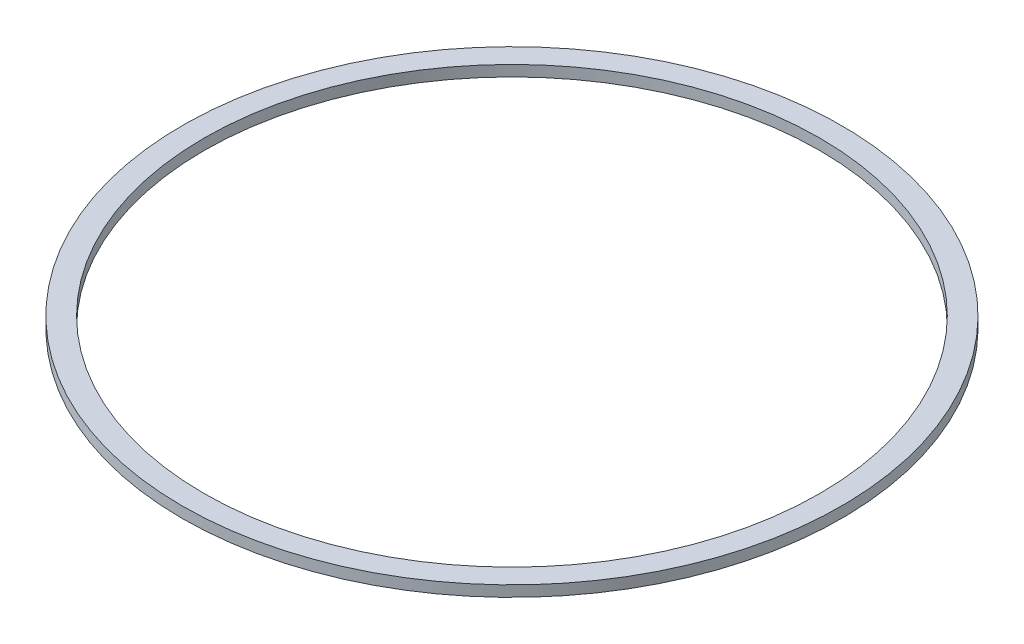
ISO-10303-21;
HEADER;
FILE_DESCRIPTION(('STEP AP214'),'2;1');
FILE_NAME('part.step','',(''),(''),'','','');
FILE_SCHEMA(('AUTOMOTIVE_DESIGN { 1 0 10303 214 1 1 1 1 }'));
ENDSEC;
DATA;
#1=APPLICATION_CONTEXT('core data for automotive mechanical design processes');
#2=APPLICATION_PROTOCOL_DEFINITION('international standard','automotive_design',2000,#1);
#3=PRODUCT_CONTEXT('',#1,'mechanical');
#4=PRODUCT('Part','Part','',(#3));
#5=PRODUCT_RELATED_PRODUCT_CATEGORY('part','',(#4));
#6=PRODUCT_DEFINITION_FORMATION('','',#4);
#7=PRODUCT_DEFINITION_CONTEXT('part definition',#1,'design');
#8=PRODUCT_DEFINITION('design','',#6,#7);
#9=PRODUCT_DEFINITION_SHAPE('','',#8);
#10=(LENGTH_UNIT() NAMED_UNIT(*) SI_UNIT(.MILLI.,.METRE.));
#11=(NAMED_UNIT(*) PLANE_ANGLE_UNIT() SI_UNIT($,.RADIAN.));
#12=(NAMED_UNIT(*) SI_UNIT($,.STERADIAN.) SOLID_ANGLE_UNIT());
#13=UNCERTAINTY_MEASURE_WITH_UNIT(LENGTH_MEASURE(1.E-05),#10,'distance_accuracy_value','');
#14=(GEOMETRIC_REPRESENTATION_CONTEXT(3) GLOBAL_UNCERTAINTY_ASSIGNED_CONTEXT((#13)) GLOBAL_UNIT_ASSIGNED_CONTEXT((#10,
#11,#12)) REPRESENTATION_CONTEXT('',''));
#15=CARTESIAN_POINT('',(0.,0.,0.));
#16=DIRECTION('',(0.,0.,1.));
#17=DIRECTION('',(1.,0.,0.));
#18=AXIS2_PLACEMENT_3D('',#15,#16,#17);
#19=CARTESIAN_POINT('',(0.,-2.5,0.));
#20=DIRECTION('',(0.,1.,0.));
#21=DIRECTION('',(0.,0.,1.));
#22=AXIS2_PLACEMENT_3D('',#19,#20,#21);
#23=PLANE('',#22);
#24=CARTESIAN_POINT('',(0.,-2.5,0.));
#25=DIRECTION('',(0.,1.,0.));
#26=DIRECTION('',(0.,0.,1.));
#27=AXIS2_PLACEMENT_3D('',#24,#25,#26);
#28=CIRCLE('',#27,75.925);
#29=CARTESIAN_POINT('',(0.,-2.5,75.925));
#30=VERTEX_POINT('',#29);
#31=EDGE_CURVE('E88',#30,#30,#28,.T.);
#32=ORIENTED_EDGE('',*,*,#31,.F.);
#33=EDGE_LOOP('',(#32));
#34=FACE_BOUND('',#33,.T.);
#35=CARTESIAN_POINT('',(0.,-2.5,0.));
#36=DIRECTION('',(0.,1.,0.));
#37=DIRECTION('',(0.,0.,1.));
#38=AXIS2_PLACEMENT_3D('',#35,#36,#37);
#39=CIRCLE('',#38,74.925);
#40=CARTESIAN_POINT('',(0.,-2.5,-74.925));
#41=VERTEX_POINT('',#40);
#42=EDGE_CURVE('E12',#41,#41,#39,.T.);
#43=ORIENTED_EDGE('',*,*,#42,.T.);
#44=EDGE_LOOP('',(#43));
#45=FACE_BOUND('',#44,.T.);
#46=ADVANCED_FACE('F57',(#34,#45),#23,.F.);
#47=CARTESIAN_POINT('',(0.,-2.5,0.));
#48=DIRECTION('',(0.,1.,0.));
#49=DIRECTION('',(0.,0.,1.));
#50=AXIS2_PLACEMENT_3D('',#47,#48,#49);
#51=CIRCLE('',#50,70.925);
#52=CARTESIAN_POINT('',(0.,-2.5,70.925));
#53=VERTEX_POINT('',#52);
#54=EDGE_CURVE('E81',#53,#53,#51,.T.);
#55=ORIENTED_EDGE('',*,*,#54,.T.);
#56=EDGE_LOOP('',(#55));
#57=FACE_BOUND('',#56,.T.);
#58=CARTESIAN_POINT('',(0.,-2.5,0.));
#59=DIRECTION('',(0.,-1.,0.));
#60=DIRECTION('',(0.,0.,-1.));
#61=AXIS2_PLACEMENT_3D('',#58,#59,#60);
#62=CIRCLE('',#61,71.925);
#63=CARTESIAN_POINT('',(0.,-2.5,-71.925));
#64=VERTEX_POINT('',#63);
#65=EDGE_CURVE('E66',#64,#64,#62,.T.);
#66=ORIENTED_EDGE('',*,*,#65,.T.);
#67=EDGE_LOOP('',(#66));
#68=FACE_BOUND('',#67,.T.);
#69=ADVANCED_FACE('F96',(#57,#68),#23,.F.);
#70=CARTESIAN_POINT('',(0.,-2.5,0.));
#71=DIRECTION('',(0.,1.,0.));
#72=DIRECTION('',(0.,0.,1.));
#73=AXIS2_PLACEMENT_3D('',#70,#71,#72);
#74=CYLINDRICAL_SURFACE('',#73,75.925);
#75=ORIENTED_EDGE('',*,*,#31,.T.);
#76=EDGE_LOOP('',(#75));
#77=FACE_BOUND('',#76,.T.);
#78=CARTESIAN_POINT('',(0.,0.,0.));
#79=DIRECTION('',(0.,1.,0.));
#80=DIRECTION('',(0.,0.,1.));
#81=AXIS2_PLACEMENT_3D('',#78,#79,#80);
#82=CIRCLE('',#81,75.925);
#83=CARTESIAN_POINT('',(0.,0.,75.925));
#84=VERTEX_POINT('',#83);
#85=EDGE_CURVE('E86',#84,#84,#82,.T.);
#86=ORIENTED_EDGE('',*,*,#85,.F.);
#87=EDGE_LOOP('',(#86));
#88=FACE_BOUND('',#87,.T.);
#89=ADVANCED_FACE('F59',(#77,#88),#74,.T.);
#90=CARTESIAN_POINT('',(0.,0.,0.));
#91=DIRECTION('',(0.,1.,0.));
#92=DIRECTION('',(0.,0.,1.));
#93=AXIS2_PLACEMENT_3D('',#90,#91,#92);
#94=PLANE('',#93);
#95=CARTESIAN_POINT('',(0.,0.,0.));
#96=DIRECTION('',(0.,1.,0.));
#97=DIRECTION('',(0.,0.,1.));
#98=AXIS2_PLACEMENT_3D('',#95,#96,#97);
#99=CIRCLE('',#98,70.925);
#100=CARTESIAN_POINT('',(0.,0.,70.925));
#101=VERTEX_POINT('',#100);
#102=EDGE_CURVE('E77',#101,#101,#99,.T.);
#103=ORIENTED_EDGE('',*,*,#102,.F.);
#104=EDGE_LOOP('',(#103));
#105=FACE_BOUND('',#104,.T.);
#106=ORIENTED_EDGE('',*,*,#85,.T.);
#107=EDGE_LOOP('',(#106));
#108=FACE_BOUND('',#107,.T.);
#109=ADVANCED_FACE('F105',(#105,#108),#94,.T.);
#110=CARTESIAN_POINT('',(0.,-2.5,0.));
#111=DIRECTION('',(0.,1.,0.));
#112=DIRECTION('',(0.,0.,1.));
#113=AXIS2_PLACEMENT_3D('',#110,#111,#112);
#114=CYLINDRICAL_SURFACE('',#113,70.925);
#115=ORIENTED_EDGE('',*,*,#54,.F.);
#116=EDGE_LOOP('',(#115));
#117=FACE_BOUND('',#116,.T.);
#118=ORIENTED_EDGE('',*,*,#102,.T.);
#119=EDGE_LOOP('',(#118));
#120=FACE_BOUND('',#119,.T.);
#121=ADVANCED_FACE('F109',(#117,#120),#114,.F.);
#122=CARTESIAN_POINT('',(0.,-2.5,0.));
#123=DIRECTION('',(0.,-1.,0.));
#124=DIRECTION('',(0.,0.,-1.));
#125=AXIS2_PLACEMENT_3D('',#122,#123,#124);
#126=TOROIDAL_SURFACE('',#125,73.425,1.5);
#127=CARTESIAN_POINT('',(0.,-2.5,-73.425));
#128=DIRECTION('',(1.,0.,0.));
#129=DIRECTION('',(0.,0.,-1.));
#130=AXIS2_PLACEMENT_3D('',#127,#128,#129);
#131=CIRCLE('',#130,1.5);
#132=EDGE_CURVE('E73',#41,#64,#131,.T.);
#133=ORIENTED_EDGE('',*,*,#132,.T.);
#134=ORIENTED_EDGE('',*,*,#65,.F.);
#135=ORIENTED_EDGE('',*,*,#132,.F.);
#136=ORIENTED_EDGE('',*,*,#42,.F.);
#137=EDGE_LOOP('',(#133,#134,#135,#136));
#138=FACE_BOUND('',#137,.T.);
#139=ADVANCED_FACE('F74',(#138),#126,.F.);
#140=CLOSED_SHELL('',(#46,#69,#89,#109,#121,#139));
#141=MANIFOLD_SOLID_BREP('B2',#140);
#142=ADVANCED_BREP_SHAPE_REPRESENTATION('',(#18,#141),#14);
#143=SHAPE_DEFINITION_REPRESENTATION(#9,#142);
ENDSEC;
END-ISO-10303-21;
